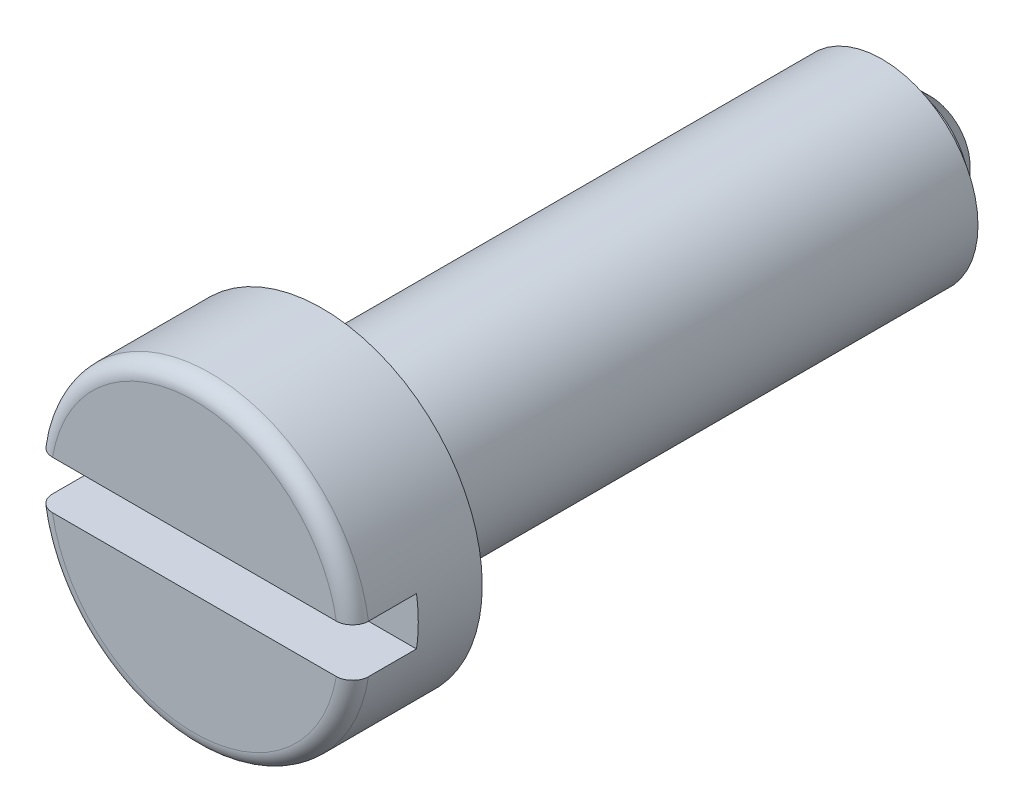
ISO-10303-21;
HEADER;
FILE_DESCRIPTION(('STEP AP214'),'2;1');
FILE_NAME('part.step','',(''),(''),'','','');
FILE_SCHEMA(('AUTOMOTIVE_DESIGN { 1 0 10303 214 1 1 1 1 }'));
ENDSEC;
DATA;
#1=APPLICATION_CONTEXT('core data for automotive mechanical design processes');
#2=APPLICATION_PROTOCOL_DEFINITION('international standard','automotive_design',2000,#1);
#3=PRODUCT_CONTEXT('',#1,'mechanical');
#4=PRODUCT('Part','Part','',(#3));
#5=PRODUCT_RELATED_PRODUCT_CATEGORY('part','',(#4));
#6=PRODUCT_DEFINITION_FORMATION('','',#4);
#7=PRODUCT_DEFINITION_CONTEXT('part definition',#1,'design');
#8=PRODUCT_DEFINITION('design','',#6,#7);
#9=PRODUCT_DEFINITION_SHAPE('','',#8);
#10=(LENGTH_UNIT() NAMED_UNIT(*) SI_UNIT(.MILLI.,.METRE.));
#11=(NAMED_UNIT(*) PLANE_ANGLE_UNIT() SI_UNIT($,.RADIAN.));
#12=(NAMED_UNIT(*) SI_UNIT($,.STERADIAN.) SOLID_ANGLE_UNIT());
#13=UNCERTAINTY_MEASURE_WITH_UNIT(LENGTH_MEASURE(1.E-05),#10,'distance_accuracy_value','');
#14=(GEOMETRIC_REPRESENTATION_CONTEXT(3) GLOBAL_UNCERTAINTY_ASSIGNED_CONTEXT((#13)) GLOBAL_UNIT_ASSIGNED_CONTEXT((#10,
#11,#12)) REPRESENTATION_CONTEXT('',''));
#15=CARTESIAN_POINT('',(0.,0.,0.));
#16=DIRECTION('',(0.,0.,1.));
#17=DIRECTION('',(1.,0.,0.));
#18=AXIS2_PLACEMENT_3D('',#15,#16,#17);
#19=CARTESIAN_POINT('',(0.,0.,-0.1));
#20=DIRECTION('',(0.,0.,-1.));
#21=DIRECTION('',(-1.,0.,0.));
#22=AXIS2_PLACEMENT_3D('',#19,#20,#21);
#23=TOROIDAL_SURFACE('',#22,0.9,0.1);
#24=CARTESIAN_POINT('',(0.887411967464941,-0.15,0.));
#25=CARTESIAN_POINT('',(0.926926603390641,-0.15,0.));
#26=CARTESIAN_POINT('',(0.957983689915386,-0.15,-0.030057713039219));
#27=CARTESIAN_POINT('',(0.988685996664551,-0.15,-0.0597720626184495));
#28=CARTESIAN_POINT('',(0.988685996664551,-0.15,-0.0999999999999371));
#29=B_SPLINE_CURVE_WITH_KNOTS('',2,(#24,#25,#26,#27,#28),.UNSPECIFIED.,.F.,.F.,(3,2,3),(0.,0.5,
1.),.UNSPECIFIED.);
#30=CARTESIAN_POINT('',(0.887411967464942,-0.15,0.));
#31=VERTEX_POINT('',#30);
#32=CARTESIAN_POINT('',(0.988685996664259,-0.15,-0.1));
#33=VERTEX_POINT('',#32);
#34=EDGE_CURVE('E116',#31,#33,#29,.T.);
#35=ORIENTED_EDGE('',*,*,#34,.F.);
#36=CARTESIAN_POINT('',(0.,0.,0.));
#37=DIRECTION('',(0.,0.,1.));
#38=DIRECTION('',(-1.,0.,0.));
#39=AXIS2_PLACEMENT_3D('',#36,#37,#38);
#40=CIRCLE('',#39,0.9);
#41=CARTESIAN_POINT('',(-0.887411967464942,-0.15,0.));
#42=VERTEX_POINT('',#41);
#43=EDGE_CURVE('E237',#42,#31,#40,.T.);
#44=ORIENTED_EDGE('',*,*,#43,.F.);
#45=CARTESIAN_POINT('',(-0.98868599666426,-0.15,-0.1));
#46=CARTESIAN_POINT('',(-0.98868599666426,-0.15,-0.060708177612476));
#47=CARTESIAN_POINT('',(-0.957979701417958,-0.15,-0.0300622207917125));
#48=CARTESIAN_POINT('',(-0.927858291510137,-0.15,8.39985633133145E-13));
#49=CARTESIAN_POINT('',(-0.887411967465139,-0.15,8.39985633133145E-13));
#50=B_SPLINE_CURVE_WITH_KNOTS('',2,(#45,#46,#47,#48,#49),.UNSPECIFIED.,.F.,.F.,(3,2,3),(0.,0.5,
1.),.UNSPECIFIED.);
#51=CARTESIAN_POINT('',(-0.98868599666426,-0.15,-0.1));
#52=VERTEX_POINT('',#51);
#53=EDGE_CURVE('E216',#52,#42,#50,.T.);
#54=ORIENTED_EDGE('',*,*,#53,.F.);
#55=CARTESIAN_POINT('',(0.,0.,-0.1));
#56=DIRECTION('',(0.,0.,-1.));
#57=DIRECTION('',(-1.,0.,0.));
#58=AXIS2_PLACEMENT_3D('',#55,#56,#57);
#59=CIRCLE('',#58,1.);
#60=EDGE_CURVE('E255',#33,#52,#59,.T.);
#61=ORIENTED_EDGE('',*,*,#60,.F.);
#62=EDGE_LOOP('',(#35,#44,#54,#61));
#63=FACE_BOUND('',#62,.T.);
#64=ADVANCED_FACE('F16',(#63),#23,.T.);
#65=CARTESIAN_POINT('',(0.,0.,-0.1));
#66=DIRECTION('',(0.,0.,-1.));
#67=DIRECTION('',(-1.,0.,0.));
#68=AXIS2_PLACEMENT_3D('',#65,#66,#67);
#69=TOROIDAL_SURFACE('',#68,0.9,0.1);
#70=CARTESIAN_POINT('',(-0.887411967464941,0.15,0.));
#71=CARTESIAN_POINT('',(-0.926926603390646,0.15,0.));
#72=CARTESIAN_POINT('',(-0.957983689915386,0.15,-0.030057713039219));
#73=CARTESIAN_POINT('',(-0.988685996664551,0.15,-0.0597720626184485));
#74=CARTESIAN_POINT('',(-0.988685996664551,0.15,-0.0999999999999375));
#75=B_SPLINE_CURVE_WITH_KNOTS('',2,(#70,#71,#72,#73,#74),.UNSPECIFIED.,.F.,.F.,(3,2,3),(0.,0.5,
1.),.UNSPECIFIED.);
#76=CARTESIAN_POINT('',(-0.887411967464942,0.15,0.));
#77=VERTEX_POINT('',#76);
#78=CARTESIAN_POINT('',(-0.98868599666426,0.149999999999998,-0.1));
#79=VERTEX_POINT('',#78);
#80=EDGE_CURVE('E28',#77,#79,#75,.T.);
#81=ORIENTED_EDGE('',*,*,#80,.F.);
#82=CARTESIAN_POINT('',(0.,0.,0.));
#83=DIRECTION('',(0.,0.,1.));
#84=DIRECTION('',(-1.,0.,0.));
#85=AXIS2_PLACEMENT_3D('',#82,#83,#84);
#86=CIRCLE('',#85,0.9);
#87=CARTESIAN_POINT('',(0.887411967464942,0.15,0.));
#88=VERTEX_POINT('',#87);
#89=EDGE_CURVE('E103',#88,#77,#86,.T.);
#90=ORIENTED_EDGE('',*,*,#89,.F.);
#91=CARTESIAN_POINT('',(0.988685996664259,0.15,-0.1));
#92=CARTESIAN_POINT('',(0.988685996664259,0.15,-0.06070817761247));
#93=CARTESIAN_POINT('',(0.957979701417958,0.15,-0.0300622207917125));
#94=CARTESIAN_POINT('',(0.927858291510131,0.15,8.39985633133145E-13));
#95=CARTESIAN_POINT('',(0.88741196746514,0.15,8.39985633133145E-13));
#96=B_SPLINE_CURVE_WITH_KNOTS('',2,(#91,#92,#93,#94,#95),.UNSPECIFIED.,.F.,.F.,(3,2,3),(0.,0.5,
1.),.UNSPECIFIED.);
#97=CARTESIAN_POINT('',(0.988685996664259,0.15,-0.1));
#98=VERTEX_POINT('',#97);
#99=EDGE_CURVE('E115',#98,#88,#96,.T.);
#100=ORIENTED_EDGE('',*,*,#99,.F.);
#101=CARTESIAN_POINT('',(0.,0.,-0.1));
#102=DIRECTION('',(0.,0.,-1.));
#103=DIRECTION('',(-1.,0.,0.));
#104=AXIS2_PLACEMENT_3D('',#101,#102,#103);
#105=CIRCLE('',#104,1.);
#106=EDGE_CURVE('E173',#79,#98,#105,.T.);
#107=ORIENTED_EDGE('',*,*,#106,.F.);
#108=EDGE_LOOP('',(#81,#90,#100,#107));
#109=FACE_BOUND('',#108,.T.);
#110=ADVANCED_FACE('F18',(#109),#69,.T.);
#111=CARTESIAN_POINT('',(0.,0.,-0.4));
#112=DIRECTION('',(0.,0.,-1.));
#113=DIRECTION('',(0.,-1.,0.));
#114=AXIS2_PLACEMENT_3D('',#111,#112,#113);
#115=PLANE('',#114);
#116=DIRECTION('',(-1.,0.,0.));
#117=VECTOR('',#116,1.);
#118=CARTESIAN_POINT('',(-0.988685996664259,-0.15,-0.4));
#119=LINE('',#118,#117);
#120=CARTESIAN_POINT('',(0.988685996664259,-0.15,-0.4));
#121=VERTEX_POINT('',#120);
#122=CARTESIAN_POINT('',(-0.98868599666426,-0.15,-0.4));
#123=VERTEX_POINT('',#122);
#124=EDGE_CURVE('E111',#121,#123,#119,.T.);
#125=ORIENTED_EDGE('',*,*,#124,.F.);
#126=CARTESIAN_POINT('',(0.,0.,-0.4));
#127=DIRECTION('',(0.,0.,-1.));
#128=DIRECTION('',(-1.,0.,0.));
#129=AXIS2_PLACEMENT_3D('',#126,#127,#128);
#130=CIRCLE('',#129,1.);
#131=CARTESIAN_POINT('',(0.988685996664259,0.15,-0.4));
#132=VERTEX_POINT('',#131);
#133=EDGE_CURVE('E105',#132,#121,#130,.T.);
#134=ORIENTED_EDGE('',*,*,#133,.F.);
#135=DIRECTION('',(1.,0.,0.));
#136=VECTOR('',#135,1.);
#137=CARTESIAN_POINT('',(0.988685996664259,0.15,-0.4));
#138=LINE('',#137,#136);
#139=CARTESIAN_POINT('',(-0.98868599666426,0.149999999999998,-0.4));
#140=VERTEX_POINT('',#139);
#141=EDGE_CURVE('E11',#140,#132,#138,.T.);
#142=ORIENTED_EDGE('',*,*,#141,.F.);
#143=CARTESIAN_POINT('',(0.,0.,-0.4));
#144=DIRECTION('',(0.,0.,-1.));
#145=DIRECTION('',(1.,0.,0.));
#146=AXIS2_PLACEMENT_3D('',#143,#144,#145);
#147=CIRCLE('',#146,1.);
#148=EDGE_CURVE('E320',#123,#140,#147,.T.);
#149=ORIENTED_EDGE('',*,*,#148,.F.);
#150=EDGE_LOOP('',(#125,#134,#142,#149));
#151=FACE_BOUND('',#150,.T.);
#152=ADVANCED_FACE('F142',(#151),#115,.F.);
#153=CARTESIAN_POINT('',(0.988685996664259,0.15,-0.4));
#154=DIRECTION('',(0.,-1.,0.));
#155=DIRECTION('',(0.,0.,-1.));
#156=AXIS2_PLACEMENT_3D('',#153,#154,#155);
#157=PLANE('',#156);
#158=DIRECTION('',(0.,0.,1.));
#159=VECTOR('',#158,1.);
#160=CARTESIAN_POINT('',(0.988685996664259,0.15,-0.4));
#161=LINE('',#160,#159);
#162=EDGE_CURVE('E165',#132,#98,#161,.T.);
#163=ORIENTED_EDGE('',*,*,#162,.T.);
#164=ORIENTED_EDGE('',*,*,#99,.T.);
#165=DIRECTION('',(1.,0.,0.));
#166=VECTOR('',#165,1.);
#167=CARTESIAN_POINT('',(0.988685996664259,0.15,0.));
#168=LINE('',#167,#166);
#169=EDGE_CURVE('E94',#77,#88,#168,.T.);
#170=ORIENTED_EDGE('',*,*,#169,.F.);
#171=ORIENTED_EDGE('',*,*,#80,.T.);
#172=DIRECTION('',(0.,0.,1.));
#173=VECTOR('',#172,1.);
#174=CARTESIAN_POINT('',(-0.98868599666426,0.149999999999998,-0.4));
#175=LINE('',#174,#173);
#176=EDGE_CURVE('E323',#140,#79,#175,.T.);
#177=ORIENTED_EDGE('',*,*,#176,.F.);
#178=ORIENTED_EDGE('',*,*,#141,.T.);
#179=EDGE_LOOP('',(#163,#164,#170,#171,#177,#178));
#180=FACE_BOUND('',#179,.T.);
#181=ADVANCED_FACE('F131',(#180),#157,.T.);
#182=CARTESIAN_POINT('',(-0.988685996664259,-0.15,-0.4));
#183=DIRECTION('',(0.,1.,0.));
#184=DIRECTION('',(1.,0.,0.));
#185=AXIS2_PLACEMENT_3D('',#182,#183,#184);
#186=PLANE('',#185);
#187=DIRECTION('',(0.,0.,1.));
#188=VECTOR('',#187,1.);
#189=CARTESIAN_POINT('',(-0.98868599666426,-0.15,-0.4));
#190=LINE('',#189,#188);
#191=EDGE_CURVE('E221',#123,#52,#190,.T.);
#192=ORIENTED_EDGE('',*,*,#191,.T.);
#193=ORIENTED_EDGE('',*,*,#53,.T.);
#194=DIRECTION('',(-1.,0.,0.));
#195=VECTOR('',#194,1.);
#196=CARTESIAN_POINT('',(-0.988685996664259,-0.15,0.));
#197=LINE('',#196,#195);
#198=EDGE_CURVE('E247',#31,#42,#197,.T.);
#199=ORIENTED_EDGE('',*,*,#198,.F.);
#200=ORIENTED_EDGE('',*,*,#34,.T.);
#201=DIRECTION('',(0.,0.,1.));
#202=VECTOR('',#201,1.);
#203=CARTESIAN_POINT('',(0.988685996664259,-0.15,-0.4));
#204=LINE('',#203,#202);
#205=EDGE_CURVE('E246',#121,#33,#204,.T.);
#206=ORIENTED_EDGE('',*,*,#205,.F.);
#207=ORIENTED_EDGE('',*,*,#124,.T.);
#208=EDGE_LOOP('',(#192,#193,#199,#200,#206,#207));
#209=FACE_BOUND('',#208,.T.);
#210=ADVANCED_FACE('F141',(#209),#186,.T.);
#211=CARTESIAN_POINT('',(0.,0.,-4.45));
#212=DIRECTION('',(0.,0.,1.));
#213=DIRECTION('',(1.,0.,0.));
#214=AXIS2_PLACEMENT_3D('',#211,#212,#213);
#215=CONICAL_SURFACE('',#214,0.4,0.785398163397449);
#216=CARTESIAN_POINT('',(0.,0.,-4.45));
#217=DIRECTION('',(0.,0.,1.));
#218=DIRECTION('',(1.,0.,0.));
#219=AXIS2_PLACEMENT_3D('',#216,#217,#218);
#220=CIRCLE('',#219,0.4);
#221=CARTESIAN_POINT('',(0.4,0.,-4.45));
#222=VERTEX_POINT('',#221);
#223=EDGE_CURVE('E117',#222,#222,#220,.T.);
#224=ORIENTED_EDGE('',*,*,#223,.F.);
#225=EDGE_LOOP('',(#224));
#226=FACE_BOUND('',#225,.T.);
#227=CARTESIAN_POINT('',(0.,0.,-4.6));
#228=DIRECTION('',(0.,0.,-1.));
#229=DIRECTION('',(1.,0.,0.));
#230=AXIS2_PLACEMENT_3D('',#227,#228,#229);
#231=CIRCLE('',#230,0.25);
#232=CARTESIAN_POINT('',(0.25,0.,-4.6));
#233=VERTEX_POINT('',#232);
#234=EDGE_CURVE('E40',#233,#233,#231,.T.);
#235=ORIENTED_EDGE('',*,*,#234,.F.);
#236=EDGE_LOOP('',(#235));
#237=FACE_BOUND('',#236,.T.);
#238=ADVANCED_FACE('F196',(#226,#237),#215,.T.);
#239=CARTESIAN_POINT('',(0.,0.,-4.6));
#240=DIRECTION('',(0.,0.,1.));
#241=DIRECTION('',(1.,0.,0.));
#242=AXIS2_PLACEMENT_3D('',#239,#240,#241);
#243=PLANE('',#242);
#244=ORIENTED_EDGE('',*,*,#234,.T.);
#245=EDGE_LOOP('',(#244));
#246=FACE_BOUND('',#245,.T.);
#247=ADVANCED_FACE('F348',(#246),#243,.F.);
#248=CARTESIAN_POINT('',(0.,0.,-4.6));
#249=DIRECTION('',(0.,0.,1.));
#250=DIRECTION('',(1.,0.,0.));
#251=AXIS2_PLACEMENT_3D('',#248,#249,#250);
#252=CYLINDRICAL_SURFACE('',#251,0.4);
#253=CARTESIAN_POINT('',(0.,0.,-4.3));
#254=DIRECTION('',(0.,0.,1.));
#255=DIRECTION('',(1.,0.,0.));
#256=AXIS2_PLACEMENT_3D('',#253,#254,#255);
#257=CIRCLE('',#256,0.4);
#258=CARTESIAN_POINT('',(0.4,0.,-4.3));
#259=VERTEX_POINT('',#258);
#260=EDGE_CURVE('E120',#259,#259,#257,.T.);
#261=ORIENTED_EDGE('',*,*,#260,.F.);
#262=EDGE_LOOP('',(#261));
#263=FACE_BOUND('',#262,.T.);
#264=ORIENTED_EDGE('',*,*,#223,.T.);
#265=EDGE_LOOP('',(#264));
#266=FACE_BOUND('',#265,.T.);
#267=ADVANCED_FACE('F302',(#263,#266),#252,.T.);
#268=CARTESIAN_POINT('',(0.,0.,-4.3));
#269=DIRECTION('',(0.,0.,1.));
#270=DIRECTION('',(1.,0.,0.));
#271=AXIS2_PLACEMENT_3D('',#268,#269,#270);
#272=PLANE('',#271);
#273=CARTESIAN_POINT('',(0.,0.,-4.3));
#274=DIRECTION('',(0.,0.,1.));
#275=DIRECTION('',(1.,0.,0.));
#276=AXIS2_PLACEMENT_3D('',#273,#274,#275);
#277=CIRCLE('',#276,0.6);
#278=CARTESIAN_POINT('',(0.6,0.,-4.3));
#279=VERTEX_POINT('',#278);
#280=EDGE_CURVE('E109',#279,#279,#277,.T.);
#281=ORIENTED_EDGE('',*,*,#280,.F.);
#282=EDGE_LOOP('',(#281));
#283=FACE_BOUND('',#282,.T.);
#284=ORIENTED_EDGE('',*,*,#260,.T.);
#285=EDGE_LOOP('',(#284));
#286=FACE_BOUND('',#285,.T.);
#287=ADVANCED_FACE('F198',(#283,#286),#272,.F.);
#288=CARTESIAN_POINT('',(0.,0.,-4.5));
#289=DIRECTION('',(0.,0.,1.));
#290=DIRECTION('',(1.,0.,0.));
#291=AXIS2_PLACEMENT_3D('',#288,#289,#290);
#292=CYLINDRICAL_SURFACE('',#291,0.6);
#293=CARTESIAN_POINT('',(0.,0.,-0.8));
#294=DIRECTION('',(0.,0.,1.));
#295=DIRECTION('',(1.,0.,0.));
#296=AXIS2_PLACEMENT_3D('',#293,#294,#295);
#297=CIRCLE('',#296,0.6);
#298=CARTESIAN_POINT('',(0.6,0.,-0.8));
#299=VERTEX_POINT('',#298);
#300=EDGE_CURVE('E90',#299,#299,#297,.T.);
#301=ORIENTED_EDGE('',*,*,#300,.F.);
#302=EDGE_LOOP('',(#301));
#303=FACE_BOUND('',#302,.T.);
#304=ORIENTED_EDGE('',*,*,#280,.T.);
#305=EDGE_LOOP('',(#304));
#306=FACE_BOUND('',#305,.T.);
#307=ADVANCED_FACE('F232',(#303,#306),#292,.T.);
#308=CARTESIAN_POINT('',(0.,0.,0.));
#309=DIRECTION('',(0.,0.,-1.));
#310=DIRECTION('',(0.,-1.,0.));
#311=AXIS2_PLACEMENT_3D('',#308,#309,#310);
#312=PLANE('',#311);
#313=ORIENTED_EDGE('',*,*,#169,.T.);
#314=ORIENTED_EDGE('',*,*,#89,.T.);
#315=EDGE_LOOP('',(#313,#314));
#316=FACE_BOUND('',#315,.T.);
#317=ADVANCED_FACE('F291',(#316),#312,.F.);
#318=CARTESIAN_POINT('',(0.,0.,-0.8));
#319=DIRECTION('',(0.,0.,-1.));
#320=DIRECTION('',(0.,-1.,0.));
#321=AXIS2_PLACEMENT_3D('',#318,#319,#320);
#322=PLANE('',#321);
#323=CARTESIAN_POINT('',(0.,0.,-0.8));
#324=DIRECTION('',(0.,0.,-1.));
#325=DIRECTION('',(1.,0.,0.));
#326=AXIS2_PLACEMENT_3D('',#323,#324,#325);
#327=CIRCLE('',#326,1.);
#328=CARTESIAN_POINT('',(1.,0.,-0.8));
#329=VERTEX_POINT('',#328);
#330=EDGE_CURVE('E95',#329,#329,#327,.T.);
#331=ORIENTED_EDGE('',*,*,#330,.T.);
#332=EDGE_LOOP('',(#331));
#333=FACE_BOUND('',#332,.T.);
#334=ORIENTED_EDGE('',*,*,#300,.T.);
#335=EDGE_LOOP('',(#334));
#336=FACE_BOUND('',#335,.T.);
#337=ADVANCED_FACE('F91',(#333,#336),#322,.T.);
#338=CARTESIAN_POINT('',(0.,0.,-0.8));
#339=DIRECTION('',(0.,0.,1.));
#340=DIRECTION('',(1.,0.,0.));
#341=AXIS2_PLACEMENT_3D('',#338,#339,#340);
#342=CYLINDRICAL_SURFACE('',#341,1.);
#343=ORIENTED_EDGE('',*,*,#330,.F.);
#344=EDGE_LOOP('',(#343));
#345=FACE_BOUND('',#344,.T.);
#346=ORIENTED_EDGE('',*,*,#205,.T.);
#347=ORIENTED_EDGE('',*,*,#60,.T.);
#348=ORIENTED_EDGE('',*,*,#191,.F.);
#349=ORIENTED_EDGE('',*,*,#148,.T.);
#350=ORIENTED_EDGE('',*,*,#176,.T.);
#351=ORIENTED_EDGE('',*,*,#106,.T.);
#352=ORIENTED_EDGE('',*,*,#162,.F.);
#353=ORIENTED_EDGE('',*,*,#133,.T.);
#354=EDGE_LOOP('',(#346,#347,#348,#349,#350,#351,#352,#353));
#355=FACE_BOUND('',#354,.T.);
#356=ADVANCED_FACE('F231',(#345,#355),#342,.T.);
#357=CARTESIAN_POINT('',(0.,0.,0.));
#358=DIRECTION('',(0.,0.,-1.));
#359=DIRECTION('',(0.,-1.,0.));
#360=AXIS2_PLACEMENT_3D('',#357,#358,#359);
#361=PLANE('',#360);
#362=ORIENTED_EDGE('',*,*,#198,.T.);
#363=ORIENTED_EDGE('',*,*,#43,.T.);
#364=EDGE_LOOP('',(#362,#363));
#365=FACE_BOUND('',#364,.T.);
#366=ADVANCED_FACE('F143',(#365),#361,.F.);
#367=CLOSED_SHELL('',(#64,#110,#152,#181,#210,#238,#247,#267,#287,#307,#317,#337,#356,#366));
#368=MANIFOLD_SOLID_BREP('B1',#367);
#369=ADVANCED_BREP_SHAPE_REPRESENTATION('',(#18,#368),#14);
#370=SHAPE_DEFINITION_REPRESENTATION(#9,#369);
ENDSEC;
END-ISO-10303-21;
